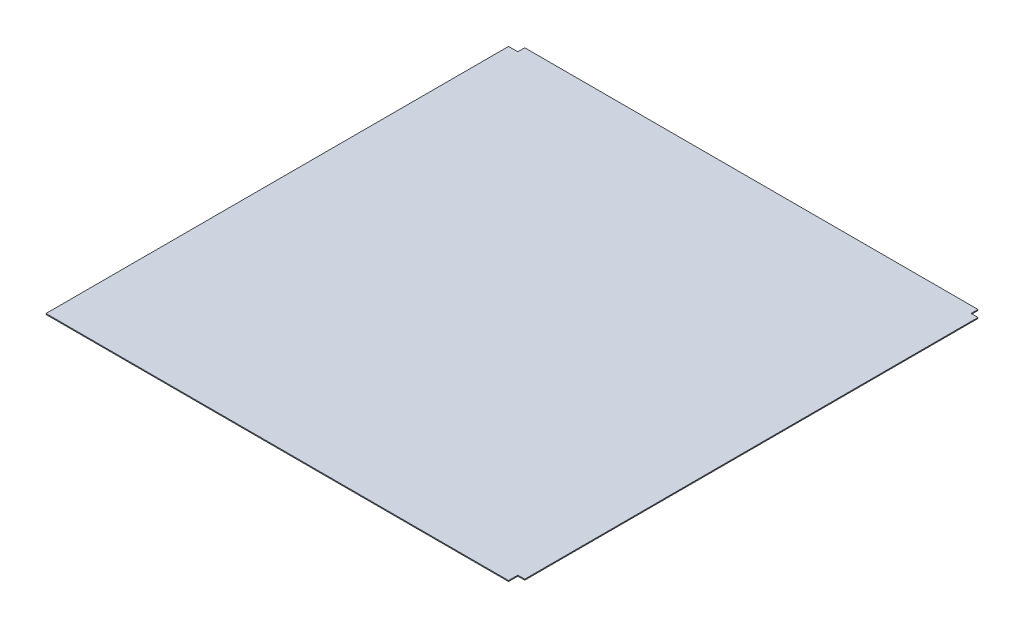
ISO-10303-21;
HEADER;
FILE_DESCRIPTION(('STEP AP214'),'2;1');
FILE_NAME('part.step','',(''),(''),'','','');
FILE_SCHEMA(('AUTOMOTIVE_DESIGN { 1 0 10303 214 1 1 1 1 }'));
ENDSEC;
DATA;
#1=APPLICATION_CONTEXT('core data for automotive mechanical design processes');
#2=APPLICATION_PROTOCOL_DEFINITION('international standard','automotive_design',2000,#1);
#3=PRODUCT_CONTEXT('',#1,'mechanical');
#4=PRODUCT('Part','Part','',(#3));
#5=PRODUCT_RELATED_PRODUCT_CATEGORY('part','',(#4));
#6=PRODUCT_DEFINITION_FORMATION('','',#4);
#7=PRODUCT_DEFINITION_CONTEXT('part definition',#1,'design');
#8=PRODUCT_DEFINITION('design','',#6,#7);
#9=PRODUCT_DEFINITION_SHAPE('','',#8);
#10=(LENGTH_UNIT() NAMED_UNIT(*) SI_UNIT(.MILLI.,.METRE.));
#11=(NAMED_UNIT(*) PLANE_ANGLE_UNIT() SI_UNIT($,.RADIAN.));
#12=(NAMED_UNIT(*) SI_UNIT($,.STERADIAN.) SOLID_ANGLE_UNIT());
#13=UNCERTAINTY_MEASURE_WITH_UNIT(LENGTH_MEASURE(1.E-05),#10,'distance_accuracy_value','');
#14=(GEOMETRIC_REPRESENTATION_CONTEXT(3) GLOBAL_UNCERTAINTY_ASSIGNED_CONTEXT((#13)) GLOBAL_UNIT_ASSIGNED_CONTEXT((#10,
#11,#12)) REPRESENTATION_CONTEXT('',''));
#15=CARTESIAN_POINT('',(0.,0.,0.));
#16=DIRECTION('',(0.,0.,1.));
#17=DIRECTION('',(1.,0.,0.));
#18=AXIS2_PLACEMENT_3D('',#15,#16,#17);
#19=CARTESIAN_POINT('',(-507.5,1.,507.5));
#20=DIRECTION('',(0.,0.,-1.));
#21=DIRECTION('',(-1.,0.,0.));
#22=AXIS2_PLACEMENT_3D('',#19,#20,#21);
#23=PLANE('',#22);
#24=DIRECTION('',(1.,0.,0.));
#25=VECTOR('',#24,1.);
#26=CARTESIAN_POINT('',(-507.5,-1.,507.5));
#27=LINE('',#26,#25);
#28=CARTESIAN_POINT('',(-507.5,-1.,507.5));
#29=VERTEX_POINT('',#28);
#30=CARTESIAN_POINT('',(492.5,-1.,507.5));
#31=VERTEX_POINT('',#30);
#32=EDGE_CURVE('E140',#29,#31,#27,.T.);
#33=ORIENTED_EDGE('',*,*,#32,.T.);
#34=DIRECTION('',(0.,-1.,0.));
#35=VECTOR('',#34,1.);
#36=CARTESIAN_POINT('',(492.5,1.,507.5));
#37=LINE('',#36,#35);
#38=CARTESIAN_POINT('',(492.5,1.,507.5));
#39=VERTEX_POINT('',#38);
#40=EDGE_CURVE('E11',#39,#31,#37,.T.);
#41=ORIENTED_EDGE('',*,*,#40,.F.);
#42=DIRECTION('',(1.,0.,0.));
#43=VECTOR('',#42,1.);
#44=CARTESIAN_POINT('',(-507.5,1.,507.5));
#45=LINE('',#44,#43);
#46=CARTESIAN_POINT('',(-507.5,1.,507.5));
#47=VERTEX_POINT('',#46);
#48=EDGE_CURVE('E158',#47,#39,#45,.T.);
#49=ORIENTED_EDGE('',*,*,#48,.F.);
#50=DIRECTION('',(0.,-1.,0.));
#51=VECTOR('',#50,1.);
#52=CARTESIAN_POINT('',(-507.5,1.,507.5));
#53=LINE('',#52,#51);
#54=EDGE_CURVE('E136',#47,#29,#53,.T.);
#55=ORIENTED_EDGE('',*,*,#54,.T.);
#56=EDGE_LOOP('',(#33,#41,#49,#55));
#57=FACE_BOUND('',#56,.T.);
#58=ADVANCED_FACE('F32',(#57),#23,.F.);
#59=CARTESIAN_POINT('',(492.5,1.,507.5));
#60=DIRECTION('',(-1.,0.,0.));
#61=DIRECTION('',(0.,0.,1.));
#62=AXIS2_PLACEMENT_3D('',#59,#60,#61);
#63=PLANE('',#62);
#64=DIRECTION('',(0.,0.,-1.));
#65=VECTOR('',#64,1.);
#66=CARTESIAN_POINT('',(492.5,-1.,507.5));
#67=LINE('',#66,#65);
#68=CARTESIAN_POINT('',(492.5,-1.,487.5));
#69=VERTEX_POINT('',#68);
#70=EDGE_CURVE('E143',#31,#69,#67,.T.);
#71=ORIENTED_EDGE('',*,*,#70,.T.);
#72=DIRECTION('',(0.,-1.,0.));
#73=VECTOR('',#72,1.);
#74=CARTESIAN_POINT('',(492.5,1.,487.5));
#75=LINE('',#74,#73);
#76=CARTESIAN_POINT('',(492.5,1.,487.5));
#77=VERTEX_POINT('',#76);
#78=EDGE_CURVE('E40',#77,#69,#75,.T.);
#79=ORIENTED_EDGE('',*,*,#78,.F.);
#80=DIRECTION('',(0.,0.,-1.));
#81=VECTOR('',#80,1.);
#82=CARTESIAN_POINT('',(492.5,1.,507.5));
#83=LINE('',#82,#81);
#84=EDGE_CURVE('E97',#39,#77,#83,.T.);
#85=ORIENTED_EDGE('',*,*,#84,.F.);
#86=ORIENTED_EDGE('',*,*,#40,.T.);
#87=EDGE_LOOP('',(#71,#79,#85,#86));
#88=FACE_BOUND('',#87,.T.);
#89=ADVANCED_FACE('F207',(#88),#63,.F.);
#90=CARTESIAN_POINT('',(507.5,1.,487.5));
#91=DIRECTION('',(0.,0.,-1.));
#92=DIRECTION('',(-1.,0.,0.));
#93=AXIS2_PLACEMENT_3D('',#90,#91,#92);
#94=PLANE('',#93);
#95=DIRECTION('',(1.,0.,0.));
#96=VECTOR('',#95,1.);
#97=CARTESIAN_POINT('',(507.5,-1.,487.5));
#98=LINE('',#97,#96);
#99=CARTESIAN_POINT('',(507.5,-1.,487.5));
#100=VERTEX_POINT('',#99);
#101=EDGE_CURVE('E145',#69,#100,#98,.T.);
#102=ORIENTED_EDGE('',*,*,#101,.T.);
#103=DIRECTION('',(0.,-1.,0.));
#104=VECTOR('',#103,1.);
#105=CARTESIAN_POINT('',(507.5,1.,487.5));
#106=LINE('',#105,#104);
#107=CARTESIAN_POINT('',(507.5,1.,487.5));
#108=VERTEX_POINT('',#107);
#109=EDGE_CURVE('E171',#108,#100,#106,.T.);
#110=ORIENTED_EDGE('',*,*,#109,.F.);
#111=DIRECTION('',(1.,0.,0.));
#112=VECTOR('',#111,1.);
#113=CARTESIAN_POINT('',(507.5,1.,487.5));
#114=LINE('',#113,#112);
#115=EDGE_CURVE('E179',#77,#108,#114,.T.);
#116=ORIENTED_EDGE('',*,*,#115,.F.);
#117=ORIENTED_EDGE('',*,*,#78,.T.);
#118=EDGE_LOOP('',(#102,#110,#116,#117));
#119=FACE_BOUND('',#118,.T.);
#120=ADVANCED_FACE('F177',(#119),#94,.F.);
#121=CARTESIAN_POINT('',(507.5,1.,-492.5));
#122=DIRECTION('',(-1.,0.,0.));
#123=DIRECTION('',(0.,0.,1.));
#124=AXIS2_PLACEMENT_3D('',#121,#122,#123);
#125=PLANE('',#124);
#126=DIRECTION('',(0.,0.,-1.));
#127=VECTOR('',#126,1.);
#128=CARTESIAN_POINT('',(507.5,-1.,-492.5));
#129=LINE('',#128,#127);
#130=CARTESIAN_POINT('',(507.5,-1.,-492.5));
#131=VERTEX_POINT('',#130);
#132=EDGE_CURVE('E147',#100,#131,#129,.T.);
#133=ORIENTED_EDGE('',*,*,#132,.T.);
#134=DIRECTION('',(0.,-1.,0.));
#135=VECTOR('',#134,1.);
#136=CARTESIAN_POINT('',(507.5,1.,-492.5));
#137=LINE('',#136,#135);
#138=CARTESIAN_POINT('',(507.5,1.,-492.5));
#139=VERTEX_POINT('',#138);
#140=EDGE_CURVE('E168',#139,#131,#137,.T.);
#141=ORIENTED_EDGE('',*,*,#140,.F.);
#142=DIRECTION('',(0.,0.,-1.));
#143=VECTOR('',#142,1.);
#144=CARTESIAN_POINT('',(507.5,1.,-492.5));
#145=LINE('',#144,#143);
#146=EDGE_CURVE('E197',#108,#139,#145,.T.);
#147=ORIENTED_EDGE('',*,*,#146,.F.);
#148=ORIENTED_EDGE('',*,*,#109,.T.);
#149=EDGE_LOOP('',(#133,#141,#147,#148));
#150=FACE_BOUND('',#149,.T.);
#151=ADVANCED_FACE('F188',(#150),#125,.F.);
#152=CARTESIAN_POINT('',(507.5,1.,-492.5));
#153=DIRECTION('',(0.,0.,1.));
#154=DIRECTION('',(1.,0.,0.));
#155=AXIS2_PLACEMENT_3D('',#152,#153,#154);
#156=PLANE('',#155);
#157=DIRECTION('',(-1.,0.,0.));
#158=VECTOR('',#157,1.);
#159=CARTESIAN_POINT('',(507.5,-1.,-492.5));
#160=LINE('',#159,#158);
#161=CARTESIAN_POINT('',(492.5,-1.,-492.5));
#162=VERTEX_POINT('',#161);
#163=EDGE_CURVE('E149',#131,#162,#160,.T.);
#164=ORIENTED_EDGE('',*,*,#163,.T.);
#165=DIRECTION('',(0.,-1.,0.));
#166=VECTOR('',#165,1.);
#167=CARTESIAN_POINT('',(492.5,1.,-492.5));
#168=LINE('',#167,#166);
#169=CARTESIAN_POINT('',(492.5,1.,-492.5));
#170=VERTEX_POINT('',#169);
#171=EDGE_CURVE('E165',#170,#162,#168,.T.);
#172=ORIENTED_EDGE('',*,*,#171,.F.);
#173=DIRECTION('',(-1.,0.,0.));
#174=VECTOR('',#173,1.);
#175=CARTESIAN_POINT('',(507.5,1.,-492.5));
#176=LINE('',#175,#174);
#177=EDGE_CURVE('E194',#139,#170,#176,.T.);
#178=ORIENTED_EDGE('',*,*,#177,.F.);
#179=ORIENTED_EDGE('',*,*,#140,.T.);
#180=EDGE_LOOP('',(#164,#172,#178,#179));
#181=FACE_BOUND('',#180,.T.);
#182=ADVANCED_FACE('F192',(#181),#156,.F.);
#183=CARTESIAN_POINT('',(492.5,1.,-507.5));
#184=DIRECTION('',(-1.,0.,0.));
#185=DIRECTION('',(0.,0.,1.));
#186=AXIS2_PLACEMENT_3D('',#183,#184,#185);
#187=PLANE('',#186);
#188=DIRECTION('',(0.,0.,-1.));
#189=VECTOR('',#188,1.);
#190=CARTESIAN_POINT('',(492.5,-1.,-507.5));
#191=LINE('',#190,#189);
#192=CARTESIAN_POINT('',(492.5,-1.,-507.5));
#193=VERTEX_POINT('',#192);
#194=EDGE_CURVE('E151',#162,#193,#191,.T.);
#195=ORIENTED_EDGE('',*,*,#194,.T.);
#196=DIRECTION('',(0.,-1.,0.));
#197=VECTOR('',#196,1.);
#198=CARTESIAN_POINT('',(492.5,1.,-507.5));
#199=LINE('',#198,#197);
#200=CARTESIAN_POINT('',(492.5,1.,-507.5));
#201=VERTEX_POINT('',#200);
#202=EDGE_CURVE('E162',#201,#193,#199,.T.);
#203=ORIENTED_EDGE('',*,*,#202,.F.);
#204=DIRECTION('',(0.,0.,-1.));
#205=VECTOR('',#204,1.);
#206=CARTESIAN_POINT('',(492.5,1.,-507.5));
#207=LINE('',#206,#205);
#208=EDGE_CURVE('E196',#170,#201,#207,.T.);
#209=ORIENTED_EDGE('',*,*,#208,.F.);
#210=ORIENTED_EDGE('',*,*,#171,.T.);
#211=EDGE_LOOP('',(#195,#203,#209,#210));
#212=FACE_BOUND('',#211,.T.);
#213=ADVANCED_FACE('F219',(#212),#187,.F.);
#214=CARTESIAN_POINT('',(-487.5,1.,-507.5));
#215=DIRECTION('',(0.,0.,1.));
#216=DIRECTION('',(1.,0.,0.));
#217=AXIS2_PLACEMENT_3D('',#214,#215,#216);
#218=PLANE('',#217);
#219=DIRECTION('',(-1.,0.,0.));
#220=VECTOR('',#219,1.);
#221=CARTESIAN_POINT('',(-487.5,-1.,-507.5));
#222=LINE('',#221,#220);
#223=CARTESIAN_POINT('',(-487.5,-1.,-507.5));
#224=VERTEX_POINT('',#223);
#225=EDGE_CURVE('E153',#193,#224,#222,.T.);
#226=ORIENTED_EDGE('',*,*,#225,.T.);
#227=DIRECTION('',(0.,-1.,0.));
#228=VECTOR('',#227,1.);
#229=CARTESIAN_POINT('',(-487.5,1.,-507.5));
#230=LINE('',#229,#228);
#231=CARTESIAN_POINT('',(-487.5,1.,-507.5));
#232=VERTEX_POINT('',#231);
#233=EDGE_CURVE('E131',#232,#224,#230,.T.);
#234=ORIENTED_EDGE('',*,*,#233,.F.);
#235=DIRECTION('',(-1.,0.,0.));
#236=VECTOR('',#235,1.);
#237=CARTESIAN_POINT('',(-487.5,1.,-507.5));
#238=LINE('',#237,#236);
#239=EDGE_CURVE('E122',#201,#232,#238,.T.);
#240=ORIENTED_EDGE('',*,*,#239,.F.);
#241=ORIENTED_EDGE('',*,*,#202,.T.);
#242=EDGE_LOOP('',(#226,#234,#240,#241));
#243=FACE_BOUND('',#242,.T.);
#244=ADVANCED_FACE('F222',(#243),#218,.F.);
#245=CARTESIAN_POINT('',(-487.5,1.,-507.5));
#246=DIRECTION('',(1.,0.,0.));
#247=DIRECTION('',(0.,0.,-1.));
#248=AXIS2_PLACEMENT_3D('',#245,#246,#247);
#249=PLANE('',#248);
#250=DIRECTION('',(0.,0.,1.));
#251=VECTOR('',#250,1.);
#252=CARTESIAN_POINT('',(-487.5,-1.,-507.5));
#253=LINE('',#252,#251);
#254=CARTESIAN_POINT('',(-487.5,-1.,-492.5));
#255=VERTEX_POINT('',#254);
#256=EDGE_CURVE('E130',#224,#255,#253,.T.);
#257=ORIENTED_EDGE('',*,*,#256,.T.);
#258=DIRECTION('',(0.,-1.,0.));
#259=VECTOR('',#258,1.);
#260=CARTESIAN_POINT('',(-487.5,1.,-492.5));
#261=LINE('',#260,#259);
#262=CARTESIAN_POINT('',(-487.5,1.,-492.5));
#263=VERTEX_POINT('',#262);
#264=EDGE_CURVE('E127',#263,#255,#261,.T.);
#265=ORIENTED_EDGE('',*,*,#264,.F.);
#266=DIRECTION('',(0.,0.,1.));
#267=VECTOR('',#266,1.);
#268=CARTESIAN_POINT('',(-487.5,1.,-507.5));
#269=LINE('',#268,#267);
#270=EDGE_CURVE('E116',#232,#263,#269,.T.);
#271=ORIENTED_EDGE('',*,*,#270,.F.);
#272=ORIENTED_EDGE('',*,*,#233,.T.);
#273=EDGE_LOOP('',(#257,#265,#271,#272));
#274=FACE_BOUND('',#273,.T.);
#275=ADVANCED_FACE('F128',(#274),#249,.F.);
#276=CARTESIAN_POINT('',(-507.5,1.,-492.5));
#277=DIRECTION('',(0.,0.,1.));
#278=DIRECTION('',(1.,0.,0.));
#279=AXIS2_PLACEMENT_3D('',#276,#277,#278);
#280=PLANE('',#279);
#281=DIRECTION('',(-1.,0.,0.));
#282=VECTOR('',#281,1.);
#283=CARTESIAN_POINT('',(-507.5,-1.,-492.5));
#284=LINE('',#283,#282);
#285=CARTESIAN_POINT('',(-507.5,-1.,-492.5));
#286=VERTEX_POINT('',#285);
#287=EDGE_CURVE('E83',#255,#286,#284,.T.);
#288=ORIENTED_EDGE('',*,*,#287,.T.);
#289=DIRECTION('',(0.,-1.,0.));
#290=VECTOR('',#289,1.);
#291=CARTESIAN_POINT('',(-507.5,1.,-492.5));
#292=LINE('',#291,#290);
#293=CARTESIAN_POINT('',(-507.5,1.,-492.5));
#294=VERTEX_POINT('',#293);
#295=EDGE_CURVE('E132',#294,#286,#292,.T.);
#296=ORIENTED_EDGE('',*,*,#295,.F.);
#297=DIRECTION('',(-1.,0.,0.));
#298=VECTOR('',#297,1.);
#299=CARTESIAN_POINT('',(-507.5,1.,-492.5));
#300=LINE('',#299,#298);
#301=EDGE_CURVE('E120',#263,#294,#300,.T.);
#302=ORIENTED_EDGE('',*,*,#301,.F.);
#303=ORIENTED_EDGE('',*,*,#264,.T.);
#304=EDGE_LOOP('',(#288,#296,#302,#303));
#305=FACE_BOUND('',#304,.T.);
#306=ADVANCED_FACE('F134',(#305),#280,.F.);
#307=CARTESIAN_POINT('',(-507.5,1.,-492.5));
#308=DIRECTION('',(1.,0.,0.));
#309=DIRECTION('',(0.,0.,-1.));
#310=AXIS2_PLACEMENT_3D('',#307,#308,#309);
#311=PLANE('',#310);
#312=DIRECTION('',(0.,0.,1.));
#313=VECTOR('',#312,1.);
#314=CARTESIAN_POINT('',(-507.5,-1.,-492.5));
#315=LINE('',#314,#313);
#316=EDGE_CURVE('E89',#286,#29,#315,.T.);
#317=ORIENTED_EDGE('',*,*,#316,.T.);
#318=ORIENTED_EDGE('',*,*,#54,.F.);
#319=DIRECTION('',(0.,0.,1.));
#320=VECTOR('',#319,1.);
#321=CARTESIAN_POINT('',(-507.5,1.,-492.5));
#322=LINE('',#321,#320);
#323=EDGE_CURVE('E48',#294,#47,#322,.T.);
#324=ORIENTED_EDGE('',*,*,#323,.F.);
#325=ORIENTED_EDGE('',*,*,#295,.T.);
#326=EDGE_LOOP('',(#317,#318,#324,#325));
#327=FACE_BOUND('',#326,.T.);
#328=ADVANCED_FACE('F231',(#327),#311,.F.);
#329=CARTESIAN_POINT('',(0.,1.,0.));
#330=DIRECTION('',(0.,1.,0.));
#331=DIRECTION('',(0.,0.,1.));
#332=AXIS2_PLACEMENT_3D('',#329,#330,#331);
#333=PLANE('',#332);
#334=ORIENTED_EDGE('',*,*,#48,.T.);
#335=ORIENTED_EDGE('',*,*,#84,.T.);
#336=ORIENTED_EDGE('',*,*,#115,.T.);
#337=ORIENTED_EDGE('',*,*,#146,.T.);
#338=ORIENTED_EDGE('',*,*,#177,.T.);
#339=ORIENTED_EDGE('',*,*,#208,.T.);
#340=ORIENTED_EDGE('',*,*,#239,.T.);
#341=ORIENTED_EDGE('',*,*,#270,.T.);
#342=ORIENTED_EDGE('',*,*,#301,.T.);
#343=ORIENTED_EDGE('',*,*,#323,.T.);
#344=EDGE_LOOP('',(#334,#335,#336,#337,#338,#339,#340,#341,#342,#343));
#345=FACE_BOUND('',#344,.T.);
#346=ADVANCED_FACE('F118',(#345),#333,.T.);
#347=CARTESIAN_POINT('',(0.,-1.,0.));
#348=DIRECTION('',(0.,1.,0.));
#349=DIRECTION('',(0.,0.,1.));
#350=AXIS2_PLACEMENT_3D('',#347,#348,#349);
#351=PLANE('',#350);
#352=ORIENTED_EDGE('',*,*,#32,.F.);
#353=ORIENTED_EDGE('',*,*,#316,.F.);
#354=ORIENTED_EDGE('',*,*,#287,.F.);
#355=ORIENTED_EDGE('',*,*,#256,.F.);
#356=ORIENTED_EDGE('',*,*,#225,.F.);
#357=ORIENTED_EDGE('',*,*,#194,.F.);
#358=ORIENTED_EDGE('',*,*,#163,.F.);
#359=ORIENTED_EDGE('',*,*,#132,.F.);
#360=ORIENTED_EDGE('',*,*,#101,.F.);
#361=ORIENTED_EDGE('',*,*,#70,.F.);
#362=EDGE_LOOP('',(#352,#353,#354,#355,#356,#357,#358,#359,#360,#361));
#363=FACE_BOUND('',#362,.T.);
#364=ADVANCED_FACE('F183',(#363),#351,.F.);
#365=CLOSED_SHELL('',(#58,#89,#120,#151,#182,#213,#244,#275,#306,#328,#346,#364));
#366=MANIFOLD_SOLID_BREP('B2',#365);
#367=ADVANCED_BREP_SHAPE_REPRESENTATION('',(#18,#366),#14);
#368=SHAPE_DEFINITION_REPRESENTATION(#9,#367);
ENDSEC;
END-ISO-10303-21;
